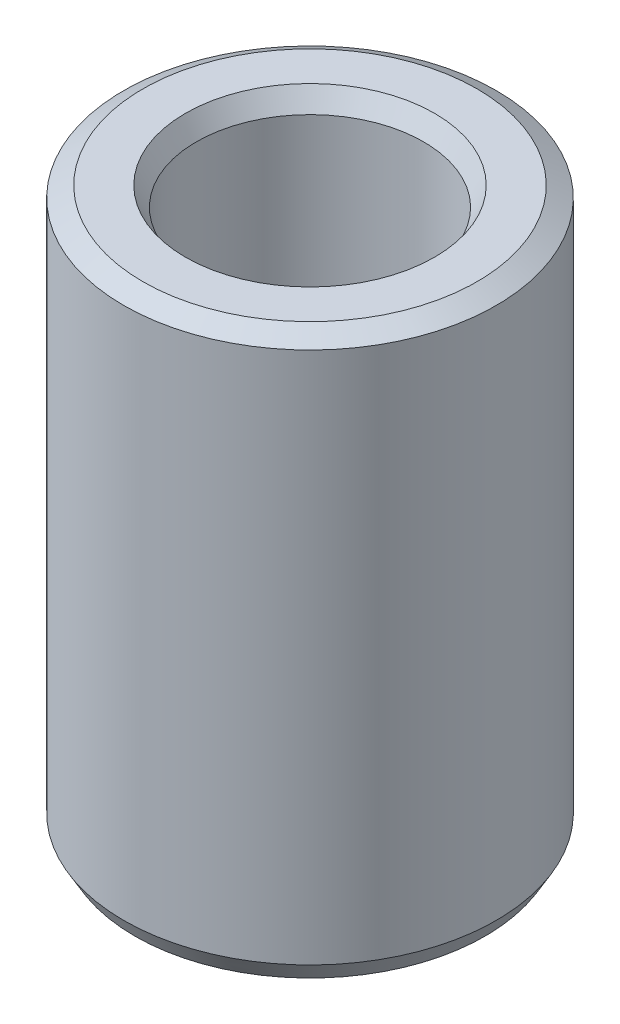
ISO-10303-21;
HEADER;
FILE_DESCRIPTION(('STEP AP214'),'2;1');
FILE_NAME('part.step','',(''),(''),'','','');
FILE_SCHEMA(('AUTOMOTIVE_DESIGN { 1 0 10303 214 1 1 1 1 }'));
ENDSEC;
DATA;
#1=APPLICATION_CONTEXT('core data for automotive mechanical design processes');
#2=APPLICATION_PROTOCOL_DEFINITION('international standard','automotive_design',2000,#1);
#3=PRODUCT_CONTEXT('',#1,'mechanical');
#4=PRODUCT('Part','Part','',(#3));
#5=PRODUCT_RELATED_PRODUCT_CATEGORY('part','',(#4));
#6=PRODUCT_DEFINITION_FORMATION('','',#4);
#7=PRODUCT_DEFINITION_CONTEXT('part definition',#1,'design');
#8=PRODUCT_DEFINITION('design','',#6,#7);
#9=PRODUCT_DEFINITION_SHAPE('','',#8);
#10=(LENGTH_UNIT() NAMED_UNIT(*) SI_UNIT(.MILLI.,.METRE.));
#11=(NAMED_UNIT(*) PLANE_ANGLE_UNIT() SI_UNIT($,.RADIAN.));
#12=(NAMED_UNIT(*) SI_UNIT($,.STERADIAN.) SOLID_ANGLE_UNIT());
#13=UNCERTAINTY_MEASURE_WITH_UNIT(LENGTH_MEASURE(1.E-05),#10,'distance_accuracy_value','');
#14=(GEOMETRIC_REPRESENTATION_CONTEXT(3) GLOBAL_UNCERTAINTY_ASSIGNED_CONTEXT((#13)) GLOBAL_UNIT_ASSIGNED_CONTEXT((#10,
#11,#12)) REPRESENTATION_CONTEXT('',''));
#15=CARTESIAN_POINT('',(0.,0.,0.));
#16=DIRECTION('',(0.,0.,1.));
#17=DIRECTION('',(1.,0.,0.));
#18=AXIS2_PLACEMENT_3D('',#15,#16,#17);
#19=CARTESIAN_POINT('',(0.,158.669275121784,0.));
#20=DIRECTION('',(0.,-1.,0.));
#21=DIRECTION('',(0.,0.,-1.));
#22=AXIS2_PLACEMENT_3D('',#19,#20,#21);
#23=CYLINDRICAL_SURFACE('',#22,52.5);
#24=CARTESIAN_POINT('',(0.,5.3910422106539,0.));
#25=DIRECTION('',(0.,1.,0.));
#26=DIRECTION('',(0.,0.,1.));
#27=AXIS2_PLACEMENT_3D('',#24,#25,#26);
#28=CIRCLE('',#27,52.5);
#29=CARTESIAN_POINT('',(0.,5.3910422106539,52.5));
#30=VERTEX_POINT('',#29);
#31=EDGE_CURVE('E10',#30,#30,#28,.T.);
#32=ORIENTED_EDGE('',*,*,#31,.T.);
#33=EDGE_LOOP('',(#32));
#34=FACE_BOUND('',#33,.T.);
#35=CARTESIAN_POINT('',(0.,155.55675545025,0.));
#36=DIRECTION('',(0.,1.,0.));
#37=DIRECTION('',(0.,0.,1.));
#38=AXIS2_PLACEMENT_3D('',#35,#36,#37);
#39=CIRCLE('',#38,52.5);
#40=CARTESIAN_POINT('',(0.,155.55675545025,-52.5));
#41=VERTEX_POINT('',#40);
#42=EDGE_CURVE('E50',#41,#41,#39,.F.);
#43=ORIENTED_EDGE('',*,*,#42,.T.);
#44=EDGE_LOOP('',(#43));
#45=FACE_BOUND('',#44,.T.);
#46=ADVANCED_FACE('F39',(#34,#45),#23,.T.);
#47=CARTESIAN_POINT('',(0.,158.669275121784,0.));
#48=DIRECTION('',(0.,1.,0.));
#49=DIRECTION('',(0.,0.,1.));
#50=AXIS2_PLACEMENT_3D('',#47,#48,#49);
#51=PLANE('',#50);
#52=CARTESIAN_POINT('',(0.,158.669275121784,0.));
#53=DIRECTION('',(0.,1.,0.));
#54=DIRECTION('',(0.,0.,1.));
#55=AXIS2_PLACEMENT_3D('',#52,#53,#54);
#56=CIRCLE('',#55,35.1369882687143);
#57=CARTESIAN_POINT('',(0.,158.669275121783,35.1369882687143));
#58=VERTEX_POINT('',#57);
#59=EDGE_CURVE('E58',#58,#58,#56,.F.);
#60=ORIENTED_EDGE('',*,*,#59,.T.);
#61=EDGE_LOOP('',(#60));
#62=FACE_BOUND('',#61,.T.);
#63=CARTESIAN_POINT('',(0.,158.669275121784,0.));
#64=DIRECTION('',(0.,1.,0.));
#65=DIRECTION('',(0.,0.,1.));
#66=AXIS2_PLACEMENT_3D('',#63,#64,#65);
#67=CIRCLE('',#66,47.1089577893461);
#68=CARTESIAN_POINT('',(0.,158.669275121783,-47.1089577893461));
#69=VERTEX_POINT('',#68);
#70=EDGE_CURVE('E61',#69,#69,#67,.T.);
#71=ORIENTED_EDGE('',*,*,#70,.T.);
#72=EDGE_LOOP('',(#71));
#73=FACE_BOUND('',#72,.T.);
#74=ADVANCED_FACE('F88',(#62,#73),#51,.T.);
#75=CARTESIAN_POINT('',(0.,0.,0.));
#76=DIRECTION('',(0.,1.,0.));
#77=DIRECTION('',(0.,0.,1.));
#78=AXIS2_PLACEMENT_3D('',#75,#76,#77);
#79=PLANE('',#78);
#80=CARTESIAN_POINT('',(0.,0.,0.));
#81=DIRECTION('',(0.,1.,0.));
#82=DIRECTION('',(0.,0.,1.));
#83=AXIS2_PLACEMENT_3D('',#80,#81,#82);
#84=CIRCLE('',#83,37.4155108078346);
#85=CARTESIAN_POINT('',(0.,0.,37.4155108078346));
#86=VERTEX_POINT('',#85);
#87=EDGE_CURVE('E51',#86,#86,#84,.T.);
#88=ORIENTED_EDGE('',*,*,#87,.T.);
#89=EDGE_LOOP('',(#88));
#90=FACE_BOUND('',#89,.T.);
#91=CARTESIAN_POINT('',(0.,0.,0.));
#92=DIRECTION('',(0.,1.,0.));
#93=DIRECTION('',(0.,0.,1.));
#94=AXIS2_PLACEMENT_3D('',#91,#92,#93);
#95=CIRCLE('',#94,49.3874803284663);
#96=CARTESIAN_POINT('',(0.,0.,49.3874803284663));
#97=VERTEX_POINT('',#96);
#98=EDGE_CURVE('E54',#97,#97,#95,.F.);
#99=ORIENTED_EDGE('',*,*,#98,.T.);
#100=EDGE_LOOP('',(#99));
#101=FACE_BOUND('',#100,.T.);
#102=ADVANCED_FACE('F83',(#90,#101),#79,.F.);
#103=CARTESIAN_POINT('',(0.,158.669275121784,0.));
#104=DIRECTION('',(0.,-1.,0.));
#105=DIRECTION('',(0.,0.,-1.));
#106=AXIS2_PLACEMENT_3D('',#103,#104,#105);
#107=CYLINDRICAL_SURFACE('',#106,32.0244685971806);
#108=CARTESIAN_POINT('',(0.,153.27823291113,0.));
#109=DIRECTION('',(0.,1.,0.));
#110=DIRECTION('',(0.,0.,1.));
#111=AXIS2_PLACEMENT_3D('',#108,#109,#110);
#112=CIRCLE('',#111,32.0244685971806);
#113=CARTESIAN_POINT('',(0.,153.27823291113,32.0244685971806));
#114=VERTEX_POINT('',#113);
#115=EDGE_CURVE('E67',#114,#114,#112,.T.);
#116=ORIENTED_EDGE('',*,*,#115,.T.);
#117=EDGE_LOOP('',(#116));
#118=FACE_BOUND('',#117,.T.);
#119=CARTESIAN_POINT('',(0.,3.11251967153373,0.));
#120=DIRECTION('',(0.,1.,0.));
#121=DIRECTION('',(0.,0.,1.));
#122=AXIS2_PLACEMENT_3D('',#119,#120,#121);
#123=CIRCLE('',#122,32.0244685971806);
#124=CARTESIAN_POINT('',(0.,3.11251967153373,32.0244685971806));
#125=VERTEX_POINT('',#124);
#126=EDGE_CURVE('E69',#125,#125,#123,.F.);
#127=ORIENTED_EDGE('',*,*,#126,.T.);
#128=EDGE_LOOP('',(#127));
#129=FACE_BOUND('',#128,.T.);
#130=ADVANCED_FACE('F71',(#118,#129),#107,.F.);
#131=CARTESIAN_POINT('',(0.,153.27823291113,0.));
#132=DIRECTION('',(0.,1.,0.));
#133=DIRECTION('',(0.,0.,1.));
#134=AXIS2_PLACEMENT_3D('',#131,#132,#133);
#135=CONICAL_SURFACE('',#134,32.0244685971806,0.523598775598298);
#136=CARTESIAN_POINT('',(0.,158.669275121783,35.1369882687143));
#137=CARTESIAN_POINT('',(0.,158.613118432089,35.1045661888025));
#138=CARTESIAN_POINT('',(0.,158.556961742395,35.0721441088907));
#139=CARTESIAN_POINT('',(0.,158.444648363006,35.0072999490671));
#140=CARTESIAN_POINT('',(0.,158.388491673312,34.9748778691553));
#141=CARTESIAN_POINT('',(0.,158.276178293923,34.9100337093316));
#142=CARTESIAN_POINT('',(0.,158.220021604229,34.8776116294198));
#143=CARTESIAN_POINT('',(0.,158.10770822484,34.8127674695962));
#144=CARTESIAN_POINT('',(0.,158.051551535146,34.7803453896844));
#145=CARTESIAN_POINT('',(0.,157.939238155757,34.7155012298608));
#146=CARTESIAN_POINT('',(0.,157.883081466063,34.683079149949));
#147=CARTESIAN_POINT('',(0.,157.770768086675,34.6182349901253));
#148=CARTESIAN_POINT('',(0.,157.71461139698,34.5858129102135));
#149=CARTESIAN_POINT('',(0.,157.602298017592,34.5209687503899));
#150=CARTESIAN_POINT('',(0.,157.546141327897,34.4885466704781));
#151=CARTESIAN_POINT('',(0.,157.433827948509,34.4237025106545));
#152=CARTESIAN_POINT('',(0.,157.377671258814,34.3912804307427));
#153=CARTESIAN_POINT('',(0.,157.265357879426,34.3264362709191));
#154=CARTESIAN_POINT('',(0.,157.209201189731,34.2940141910073));
#155=CARTESIAN_POINT('',(0.,157.096887810343,34.2291700311836));
#156=CARTESIAN_POINT('',(0.,157.040731120648,34.1967479512718));
#157=CARTESIAN_POINT('',(0.,156.92841774126,34.1319037914482));
#158=CARTESIAN_POINT('',(0.,156.872261051566,34.0994817115364));
#159=CARTESIAN_POINT('',(0.,156.759947672177,34.0346375517128));
#160=CARTESIAN_POINT('',(0.,156.703790982483,34.002215471801));
#161=CARTESIAN_POINT('',(0.,156.591477603094,33.9373713119774));
#162=CARTESIAN_POINT('',(0.,156.5353209134,33.9049492320655));
#163=CARTESIAN_POINT('',(0.,156.423007534011,33.8401050722419));
#164=CARTESIAN_POINT('',(0.,156.366850844317,33.8076829923301));
#165=CARTESIAN_POINT('',(0.,156.254537464928,33.7428388325065));
#166=CARTESIAN_POINT('',(0.,156.198380775234,33.7104167525947));
#167=CARTESIAN_POINT('',(0.,156.086067395845,33.6455725927711));
#168=CARTESIAN_POINT('',(0.,156.029910706151,33.6131505128593));
#169=CARTESIAN_POINT('',(0.,155.917597326762,33.5483063530356));
#170=CARTESIAN_POINT('',(0.,155.861440637068,33.5158842731238));
#171=CARTESIAN_POINT('',(0.,155.749127257679,33.4510401133002));
#172=CARTESIAN_POINT('',(0.,155.692970567985,33.4186180333884));
#173=CARTESIAN_POINT('',(0.,155.580657188596,33.3537738735648));
#174=CARTESIAN_POINT('',(0.,155.524500498902,33.321351793653));
#175=CARTESIAN_POINT('',(0.,155.412187119513,33.2565076338294));
#176=CARTESIAN_POINT('',(0.,155.356030429819,33.2240855539176));
#177=CARTESIAN_POINT('',(0.,155.24371705043,33.1592413940939));
#178=CARTESIAN_POINT('',(0.,155.187560360736,33.1268193141821));
#179=CARTESIAN_POINT('',(0.,155.075246981348,33.0619751543585));
#180=CARTESIAN_POINT('',(0.,155.019090291653,33.0295530744467));
#181=CARTESIAN_POINT('',(0.,154.906776912265,32.9647089146231));
#182=CARTESIAN_POINT('',(0.,154.85062022257,32.9322868347113));
#183=CARTESIAN_POINT('',(0.,154.738306843182,32.8674426748876));
#184=CARTESIAN_POINT('',(0.,154.682150153487,32.8350205949758));
#185=CARTESIAN_POINT('',(0.,154.569836774099,32.7701764351522));
#186=CARTESIAN_POINT('',(0.,154.513680084404,32.7377543552404));
#187=CARTESIAN_POINT('',(0.,154.401366705016,32.6729101954168));
#188=CARTESIAN_POINT('',(0.,154.345210015321,32.640488115505));
#189=CARTESIAN_POINT('',(0.,154.232896635933,32.5756439556814));
#190=CARTESIAN_POINT('',(0.,154.176739946239,32.5432218757696));
#191=CARTESIAN_POINT('',(0.,154.06442656685,32.4783777159459));
#192=CARTESIAN_POINT('',(0.,154.008269877156,32.4459556360341));
#193=CARTESIAN_POINT('',(0.,153.895956497767,32.3811114762105));
#194=CARTESIAN_POINT('',(0.,153.839799808073,32.3486893962987));
#195=CARTESIAN_POINT('',(0.,153.727486428684,32.2838452364751));
#196=CARTESIAN_POINT('',(0.,153.67132973899,32.2514231565633));
#197=CARTESIAN_POINT('',(0.,153.559016359601,32.1865789967397));
#198=CARTESIAN_POINT('',(0.,153.502859669907,32.1541569168278));
#199=CARTESIAN_POINT('',(0.,153.390546290518,32.0893127570042));
#200=CARTESIAN_POINT('',(0.,153.334389600824,32.0568906770924));
#201=CARTESIAN_POINT('',(0.,153.27823291113,32.0244685971806));
#202=B_SPLINE_CURVE_WITH_KNOTS('',3,(#136,#137,#138,#139,#140,#141,#142,#143,#144,#145,#146,
#147,#148,#149,#150,#151,#152,#153,#154,#155,#156,#157,#158,#159,#160,#161,#162,#163,#164,#165,
#166,#167,#168,#169,#170,#171,#172,#173,#174,#175,#176,#177,#178,#179,#180,#181,#182,#183,#184,
#185,#186,#187,#188,#189,#190,#191,#192,#193,#194,#195,#196,#197,#198,#199,#200,#201),
.UNSPECIFIED.,.F.,.F.,(4,2,2,2,2,2,2,2,2,2,2,2,2,2,2,2,2,2,2,2,2,2,2,2,2,2,2,2,2,2,2,2,4),(0.,
0.194532479470835,0.389064958941691,0.58359743841255,0.778129917883406,0.972662397354265,
1.16719487682512,1.36172735629598,1.55625983576684,1.75079231523769,1.94532479470855,
2.13985727417941,2.33438975365027,2.52892223312112,2.72345471259198,2.91798719206284,
3.11251967153369,3.30705215100453,3.50158463047539,3.69611710994624,3.8906495894171,
4.08518206888796,4.27971454835881,4.47424702782967,4.66877950730053,4.86331198677139,
5.05784446624224,5.2523769457131,5.44690942518396,5.64144190465482,5.83597438412568,
6.03050686359654,6.22503934306737),.UNSPECIFIED.);
#203=EDGE_CURVE('BSEAM77',#58,#114,#202,.T.);
#204=ORIENTED_EDGE('',*,*,#59,.F.);
#205=ORIENTED_EDGE('',*,*,#115,.F.);
#206=ORIENTED_EDGE('',*,*,#203,.T.);
#207=ORIENTED_EDGE('',*,*,#203,.F.);
#208=EDGE_LOOP('',(#204,#206,#205,#207));
#209=FACE_BOUND('',#208,.T.);
#210=ADVANCED_FACE('F77',(#209),#135,.F.);
#211=CARTESIAN_POINT('',(0.,0.,0.));
#212=DIRECTION('',(0.,-1.,0.));
#213=DIRECTION('',(0.,0.,-1.));
#214=AXIS2_PLACEMENT_3D('',#211,#212,#213);
#215=CONICAL_SURFACE('',#214,37.4155108078346,1.04719755119659);
#216=ORIENTED_EDGE('',*,*,#126,.F.);
#217=EDGE_LOOP('',(#216));
#218=FACE_BOUND('',#217,.T.);
#219=ORIENTED_EDGE('',*,*,#87,.F.);
#220=EDGE_LOOP('',(#219));
#221=FACE_BOUND('',#220,.T.);
#222=ADVANCED_FACE('F73',(#218,#221),#215,.F.);
#223=CARTESIAN_POINT('',(0.,5.3910422106539,0.));
#224=DIRECTION('',(0.,1.,0.));
#225=DIRECTION('',(0.,0.,1.));
#226=AXIS2_PLACEMENT_3D('',#223,#224,#225);
#227=CONICAL_SURFACE('',#226,52.5,0.523598775598302);
#228=ORIENTED_EDGE('',*,*,#98,.F.);
#229=EDGE_LOOP('',(#228));
#230=FACE_BOUND('',#229,.T.);
#231=ORIENTED_EDGE('',*,*,#31,.F.);
#232=EDGE_LOOP('',(#231));
#233=FACE_BOUND('',#232,.T.);
#234=ADVANCED_FACE('F76',(#230,#233),#227,.T.);
#235=CARTESIAN_POINT('',(0.,158.669275121784,0.));
#236=DIRECTION('',(0.,-1.,0.));
#237=DIRECTION('',(0.,0.,-1.));
#238=AXIS2_PLACEMENT_3D('',#235,#236,#237);
#239=CONICAL_SURFACE('',#238,47.1089577893461,1.04719755119659);
#240=CARTESIAN_POINT('',(0.,155.55675545025,-52.5));
#241=CARTESIAN_POINT('',(0.,155.589177530162,-52.4438433103057));
#242=CARTESIAN_POINT('',(0.,155.621599610073,-52.3876866206114));
#243=CARTESIAN_POINT('',(0.,155.686443769897,-52.2753732412228));
#244=CARTESIAN_POINT('',(0.,155.718865849809,-52.2192165515285));
#245=CARTESIAN_POINT('',(0.,155.783710009632,-52.1069031721398));
#246=CARTESIAN_POINT('',(0.,155.816132089544,-52.0507464824455));
#247=CARTESIAN_POINT('',(0.,155.880976249368,-51.9384331030569));
#248=CARTESIAN_POINT('',(0.,155.91339832928,-51.8822764133626));
#249=CARTESIAN_POINT('',(0.,155.978242489103,-51.769963033974));
#250=CARTESIAN_POINT('',(0.,156.010664569015,-51.7138063442797));
#251=CARTESIAN_POINT('',(0.,156.075508728839,-51.601492964891));
#252=CARTESIAN_POINT('',(0.,156.107930808751,-51.5453362751967));
#253=CARTESIAN_POINT('',(0.,156.172774968574,-51.4330228958081));
#254=CARTESIAN_POINT('',(0.,156.205197048486,-51.3768662061138));
#255=CARTESIAN_POINT('',(0.,156.27004120831,-51.2645528267252));
#256=CARTESIAN_POINT('',(0.,156.302463288221,-51.2083961370309));
#257=CARTESIAN_POINT('',(0.,156.367307448045,-51.0960827576422));
#258=CARTESIAN_POINT('',(0.,156.399729527957,-51.0399260679479));
#259=CARTESIAN_POINT('',(0.,156.46457368778,-50.9276126885593));
#260=CARTESIAN_POINT('',(0.,156.496995767692,-50.871455998865));
#261=CARTESIAN_POINT('',(0.,156.561839927516,-50.7591426194764));
#262=CARTESIAN_POINT('',(0.,156.594262007428,-50.7029859297821));
#263=CARTESIAN_POINT('',(0.,156.659106167251,-50.5906725503934));
#264=CARTESIAN_POINT('',(0.,156.691528247163,-50.5345158606991));
#265=CARTESIAN_POINT('',(0.,156.756372406987,-50.4222024813105));
#266=CARTESIAN_POINT('',(0.,156.788794486899,-50.3660457916162));
#267=CARTESIAN_POINT('',(0.,156.853638646722,-50.2537324122276));
#268=CARTESIAN_POINT('',(0.,156.886060726634,-50.1975757225333));
#269=CARTESIAN_POINT('',(0.,156.950904886458,-50.0852623431446));
#270=CARTESIAN_POINT('',(0.,156.983326966369,-50.0291056534503));
#271=CARTESIAN_POINT('',(0.,157.048171126193,-49.9167922740617));
#272=CARTESIAN_POINT('',(0.,157.080593206105,-49.8606355843674));
#273=CARTESIAN_POINT('',(0.,157.145437365928,-49.7483222049788));
#274=CARTESIAN_POINT('',(0.,157.17785944584,-49.6921655152844));
#275=CARTESIAN_POINT('',(0.,157.242703605664,-49.5798521358958));
#276=CARTESIAN_POINT('',(0.,157.275125685576,-49.5236954462015));
#277=CARTESIAN_POINT('',(0.,157.339969845399,-49.4113820668129));
#278=CARTESIAN_POINT('',(0.,157.372391925311,-49.3552253771186));
#279=CARTESIAN_POINT('',(0.,157.437236085135,-49.24291199773));
#280=CARTESIAN_POINT('',(0.,157.469658165047,-49.1867553080356));
#281=CARTESIAN_POINT('',(0.,157.53450232487,-49.074441928647));
#282=CARTESIAN_POINT('',(0.,157.566924404782,-49.0182852389527));
#283=CARTESIAN_POINT('',(0.,157.631768564606,-48.9059718595641));
#284=CARTESIAN_POINT('',(0.,157.664190644517,-48.8498151698698));
#285=CARTESIAN_POINT('',(0.,157.729034804341,-48.7375017904811));
#286=CARTESIAN_POINT('',(0.,157.761456884253,-48.6813451007868));
#287=CARTESIAN_POINT('',(0.,157.826301044076,-48.5690317213982));
#288=CARTESIAN_POINT('',(0.,157.858723123988,-48.5128750317039));
#289=CARTESIAN_POINT('',(0.,157.923567283812,-48.4005616523153));
#290=CARTESIAN_POINT('',(0.,157.955989363724,-48.344404962621));
#291=CARTESIAN_POINT('',(0.,158.020833523547,-48.2320915832323));
#292=CARTESIAN_POINT('',(0.,158.053255603459,-48.175934893538));
#293=CARTESIAN_POINT('',(0.,158.118099763283,-48.0636215141494));
#294=CARTESIAN_POINT('',(0.,158.150521843195,-48.0074648244551));
#295=CARTESIAN_POINT('',(0.,158.215366003018,-47.8951514450665));
#296=CARTESIAN_POINT('',(0.,158.24778808293,-47.8389947553722));
#297=CARTESIAN_POINT('',(0.,158.312632242754,-47.7266813759836));
#298=CARTESIAN_POINT('',(0.,158.345054322665,-47.6705246862892));
#299=CARTESIAN_POINT('',(0.,158.409898482489,-47.5582113069006));
#300=CARTESIAN_POINT('',(0.,158.442320562401,-47.5020546172063));
#301=CARTESIAN_POINT('',(0.,158.507164722224,-47.3897412378177));
#302=CARTESIAN_POINT('',(0.,158.539586802136,-47.3335845481234));
#303=CARTESIAN_POINT('',(0.,158.60443096196,-47.2212711687347));
#304=CARTESIAN_POINT('',(0.,158.636853041872,-47.1651144790404));
#305=CARTESIAN_POINT('',(0.,158.669275121784,-47.1089577893461));
#306=B_SPLINE_CURVE_WITH_KNOTS('',3,(#240,#241,#242,#243,#244,#245,#246,#247,#248,#249,#250,
#251,#252,#253,#254,#255,#256,#257,#258,#259,#260,#261,#262,#263,#264,#265,#266,#267,#268,#269,
#270,#271,#272,#273,#274,#275,#276,#277,#278,#279,#280,#281,#282,#283,#284,#285,#286,#287,#288,
#289,#290,#291,#292,#293,#294,#295,#296,#297,#298,#299,#300,#301,#302,#303,#304,#305),
.UNSPECIFIED.,.F.,.F.,(4,2,2,2,2,2,2,2,2,2,2,2,2,2,2,2,2,2,2,2,2,2,2,2,2,2,2,2,2,2,2,2,4),(0.,
0.194532479470857,0.389064958941713,0.583597438412562,0.778129917883425,0.972662397354281,
1.16719487682513,1.36172735629599,1.55625983576684,1.75079231523769,1.94532479470855,
2.1398572741794,2.33438975365026,2.52892223312112,2.72345471259197,2.91798719206282,
3.11251967153367,3.30705215100453,3.50158463047539,3.69611710994624,3.89064958941709,
4.08518206888796,4.2797145483588,4.47424702782966,4.66877950730052,4.86331198677137,
5.05784446624223,5.25237694571308,5.44690942518393,5.6414419046548,5.83597438412564,
6.0305068635965,6.22503934306737),.UNSPECIFIED.);
#307=EDGE_CURVE('BSEAM45',#41,#69,#306,.T.);
#308=ORIENTED_EDGE('',*,*,#42,.F.);
#309=ORIENTED_EDGE('',*,*,#70,.F.);
#310=ORIENTED_EDGE('',*,*,#307,.T.);
#311=ORIENTED_EDGE('',*,*,#307,.F.);
#312=EDGE_LOOP('',(#308,#310,#309,#311));
#313=FACE_BOUND('',#312,.T.);
#314=ADVANCED_FACE('F45',(#313),#239,.T.);
#315=CLOSED_SHELL('',(#46,#74,#102,#130,#210,#222,#234,#314));
#316=MANIFOLD_SOLID_BREP('B2',#315);
#317=ADVANCED_BREP_SHAPE_REPRESENTATION('',(#18,#316),#14);
#318=SHAPE_DEFINITION_REPRESENTATION(#9,#317);
ENDSEC;
END-ISO-10303-21;
